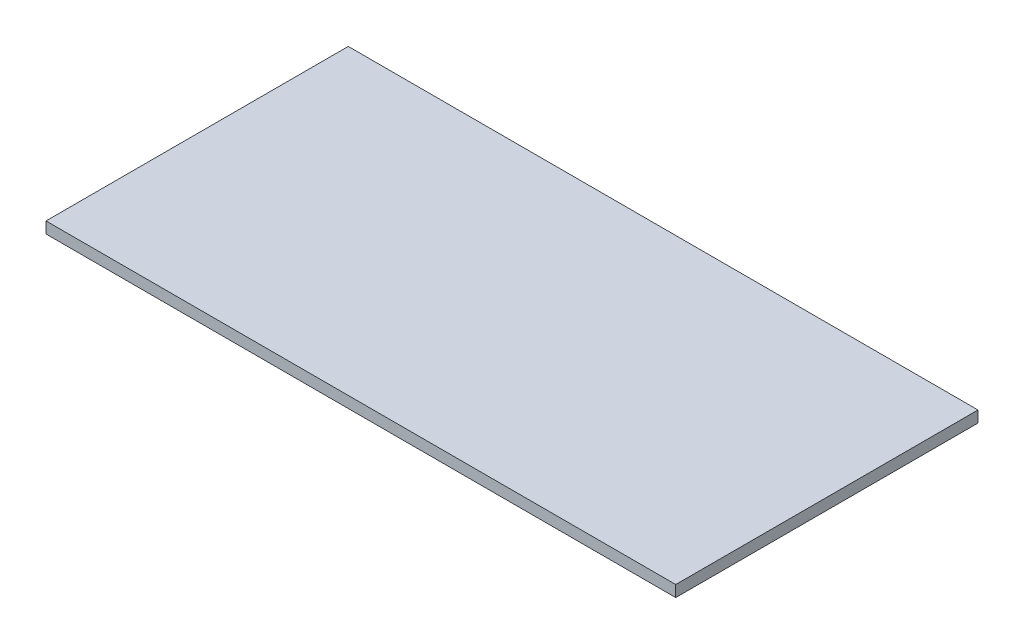
ISO-10303-21;
HEADER;
FILE_DESCRIPTION(('STEP AP214'),'2;1');
FILE_NAME('part.step','',(''),(''),'','','');
FILE_SCHEMA(('AUTOMOTIVE_DESIGN { 1 0 10303 214 1 1 1 1 }'));
ENDSEC;
DATA;
#1=APPLICATION_CONTEXT('core data for automotive mechanical design processes');
#2=APPLICATION_PROTOCOL_DEFINITION('international standard','automotive_design',2000,#1);
#3=PRODUCT_CONTEXT('',#1,'mechanical');
#4=PRODUCT('Part','Part','',(#3));
#5=PRODUCT_RELATED_PRODUCT_CATEGORY('part','',(#4));
#6=PRODUCT_DEFINITION_FORMATION('','',#4);
#7=PRODUCT_DEFINITION_CONTEXT('part definition',#1,'design');
#8=PRODUCT_DEFINITION('design','',#6,#7);
#9=PRODUCT_DEFINITION_SHAPE('','',#8);
#10=(LENGTH_UNIT() NAMED_UNIT(*) SI_UNIT(.MILLI.,.METRE.));
#11=(NAMED_UNIT(*) PLANE_ANGLE_UNIT() SI_UNIT($,.RADIAN.));
#12=(NAMED_UNIT(*) SI_UNIT($,.STERADIAN.) SOLID_ANGLE_UNIT());
#13=UNCERTAINTY_MEASURE_WITH_UNIT(LENGTH_MEASURE(1.E-05),#10,'distance_accuracy_value','');
#14=(GEOMETRIC_REPRESENTATION_CONTEXT(3) GLOBAL_UNCERTAINTY_ASSIGNED_CONTEXT((#13)) GLOBAL_UNIT_ASSIGNED_CONTEXT((#10,
#11,#12)) REPRESENTATION_CONTEXT('',''));
#15=CARTESIAN_POINT('',(0.,0.,0.));
#16=DIRECTION('',(0.,0.,1.));
#17=DIRECTION('',(1.,0.,0.));
#18=AXIS2_PLACEMENT_3D('',#15,#16,#17);
#19=CARTESIAN_POINT('',(0.,1.8,0.));
#20=DIRECTION('',(1.,0.,0.));
#21=DIRECTION('',(0.,0.,-1.));
#22=AXIS2_PLACEMENT_3D('',#19,#20,#21);
#23=PLANE('',#22);
#24=DIRECTION('',(0.,0.,1.));
#25=VECTOR('',#24,1.);
#26=CARTESIAN_POINT('',(0.,0.,0.));
#27=LINE('',#26,#25);
#28=CARTESIAN_POINT('',(0.,0.,-48.));
#29=VERTEX_POINT('',#28);
#30=CARTESIAN_POINT('',(0.,0.,0.));
#31=VERTEX_POINT('',#30);
#32=EDGE_CURVE('E98',#29,#31,#27,.T.);
#33=ORIENTED_EDGE('',*,*,#32,.T.);
#34=DIRECTION('',(0.,-1.,0.));
#35=VECTOR('',#34,1.);
#36=CARTESIAN_POINT('',(0.,1.8,0.));
#37=LINE('',#36,#35);
#38=CARTESIAN_POINT('',(0.,1.8,0.));
#39=VERTEX_POINT('',#38);
#40=EDGE_CURVE('E11',#39,#31,#37,.T.);
#41=ORIENTED_EDGE('',*,*,#40,.F.);
#42=DIRECTION('',(0.,0.,1.));
#43=VECTOR('',#42,1.);
#44=CARTESIAN_POINT('',(0.,1.8,0.));
#45=LINE('',#44,#43);
#46=CARTESIAN_POINT('',(0.,1.8,-48.));
#47=VERTEX_POINT('',#46);
#48=EDGE_CURVE('E86',#47,#39,#45,.T.);
#49=ORIENTED_EDGE('',*,*,#48,.F.);
#50=DIRECTION('',(0.,-1.,0.));
#51=VECTOR('',#50,1.);
#52=CARTESIAN_POINT('',(0.,1.8,-48.));
#53=LINE('',#52,#51);
#54=EDGE_CURVE('E94',#47,#29,#53,.T.);
#55=ORIENTED_EDGE('',*,*,#54,.T.);
#56=EDGE_LOOP('',(#33,#41,#49,#55));
#57=FACE_BOUND('',#56,.T.);
#58=ADVANCED_FACE('F35',(#57),#23,.F.);
#59=CARTESIAN_POINT('',(0.,1.8,0.));
#60=DIRECTION('',(0.,0.,-1.));
#61=DIRECTION('',(-1.,0.,0.));
#62=AXIS2_PLACEMENT_3D('',#59,#60,#61);
#63=PLANE('',#62);
#64=DIRECTION('',(1.,0.,0.));
#65=VECTOR('',#64,1.);
#66=CARTESIAN_POINT('',(0.,0.,0.));
#67=LINE('',#66,#65);
#68=CARTESIAN_POINT('',(100.,0.,0.));
#69=VERTEX_POINT('',#68);
#70=EDGE_CURVE('E90',#31,#69,#67,.T.);
#71=ORIENTED_EDGE('',*,*,#70,.T.);
#72=DIRECTION('',(0.,-1.,0.));
#73=VECTOR('',#72,1.);
#74=CARTESIAN_POINT('',(100.,1.8,0.));
#75=LINE('',#74,#73);
#76=CARTESIAN_POINT('',(100.,1.8,0.));
#77=VERTEX_POINT('',#76);
#78=EDGE_CURVE('E43',#77,#69,#75,.T.);
#79=ORIENTED_EDGE('',*,*,#78,.F.);
#80=DIRECTION('',(1.,0.,0.));
#81=VECTOR('',#80,1.);
#82=CARTESIAN_POINT('',(0.,1.8,0.));
#83=LINE('',#82,#81);
#84=EDGE_CURVE('E81',#39,#77,#83,.T.);
#85=ORIENTED_EDGE('',*,*,#84,.F.);
#86=ORIENTED_EDGE('',*,*,#40,.T.);
#87=EDGE_LOOP('',(#71,#79,#85,#86));
#88=FACE_BOUND('',#87,.T.);
#89=ADVANCED_FACE('F89',(#88),#63,.F.);
#90=CARTESIAN_POINT('',(100.,1.8,0.));
#91=DIRECTION('',(-1.,0.,0.));
#92=DIRECTION('',(0.,0.,1.));
#93=AXIS2_PLACEMENT_3D('',#90,#91,#92);
#94=PLANE('',#93);
#95=DIRECTION('',(0.,0.,-1.));
#96=VECTOR('',#95,1.);
#97=CARTESIAN_POINT('',(100.,0.,0.));
#98=LINE('',#97,#96);
#99=CARTESIAN_POINT('',(100.,0.,-48.));
#100=VERTEX_POINT('',#99);
#101=EDGE_CURVE('E68',#69,#100,#98,.T.);
#102=ORIENTED_EDGE('',*,*,#101,.T.);
#103=DIRECTION('',(0.,-1.,0.));
#104=VECTOR('',#103,1.);
#105=CARTESIAN_POINT('',(100.,1.8,-48.));
#106=LINE('',#105,#104);
#107=CARTESIAN_POINT('',(100.,1.8,-48.));
#108=VERTEX_POINT('',#107);
#109=EDGE_CURVE('E91',#108,#100,#106,.T.);
#110=ORIENTED_EDGE('',*,*,#109,.F.);
#111=DIRECTION('',(0.,0.,-1.));
#112=VECTOR('',#111,1.);
#113=CARTESIAN_POINT('',(100.,1.8,0.));
#114=LINE('',#113,#112);
#115=EDGE_CURVE('E84',#77,#108,#114,.T.);
#116=ORIENTED_EDGE('',*,*,#115,.F.);
#117=ORIENTED_EDGE('',*,*,#78,.T.);
#118=EDGE_LOOP('',(#102,#110,#116,#117));
#119=FACE_BOUND('',#118,.T.);
#120=ADVANCED_FACE('F92',(#119),#94,.F.);
#121=CARTESIAN_POINT('',(0.,1.8,-48.));
#122=DIRECTION('',(0.,0.,1.));
#123=DIRECTION('',(1.,0.,0.));
#124=AXIS2_PLACEMENT_3D('',#121,#122,#123);
#125=PLANE('',#124);
#126=DIRECTION('',(-1.,0.,0.));
#127=VECTOR('',#126,1.);
#128=CARTESIAN_POINT('',(0.,0.,-48.));
#129=LINE('',#128,#127);
#130=EDGE_CURVE('E74',#100,#29,#129,.T.);
#131=ORIENTED_EDGE('',*,*,#130,.T.);
#132=ORIENTED_EDGE('',*,*,#54,.F.);
#133=DIRECTION('',(-1.,0.,0.));
#134=VECTOR('',#133,1.);
#135=CARTESIAN_POINT('',(0.,1.8,-48.));
#136=LINE('',#135,#134);
#137=EDGE_CURVE('E51',#108,#47,#136,.T.);
#138=ORIENTED_EDGE('',*,*,#137,.F.);
#139=ORIENTED_EDGE('',*,*,#109,.T.);
#140=EDGE_LOOP('',(#131,#132,#138,#139));
#141=FACE_BOUND('',#140,.T.);
#142=ADVANCED_FACE('F105',(#141),#125,.F.);
#143=CARTESIAN_POINT('',(0.,1.8,0.));
#144=DIRECTION('',(0.,-1.,0.));
#145=DIRECTION('',(0.,0.,-1.));
#146=AXIS2_PLACEMENT_3D('',#143,#144,#145);
#147=PLANE('',#146);
#148=ORIENTED_EDGE('',*,*,#48,.T.);
#149=ORIENTED_EDGE('',*,*,#84,.T.);
#150=ORIENTED_EDGE('',*,*,#115,.T.);
#151=ORIENTED_EDGE('',*,*,#137,.T.);
#152=EDGE_LOOP('',(#148,#149,#150,#151));
#153=FACE_BOUND('',#152,.T.);
#154=ADVANCED_FACE('F82',(#153),#147,.F.);
#155=CARTESIAN_POINT('',(0.,0.,0.));
#156=DIRECTION('',(0.,-1.,0.));
#157=DIRECTION('',(0.,0.,-1.));
#158=AXIS2_PLACEMENT_3D('',#155,#156,#157);
#159=PLANE('',#158);
#160=ORIENTED_EDGE('',*,*,#32,.F.);
#161=ORIENTED_EDGE('',*,*,#130,.F.);
#162=ORIENTED_EDGE('',*,*,#101,.F.);
#163=ORIENTED_EDGE('',*,*,#70,.F.);
#164=EDGE_LOOP('',(#160,#161,#162,#163));
#165=FACE_BOUND('',#164,.T.);
#166=ADVANCED_FACE('F108',(#165),#159,.T.);
#167=CLOSED_SHELL('',(#58,#89,#120,#142,#154,#166));
#168=MANIFOLD_SOLID_BREP('B2',#167);
#169=ADVANCED_BREP_SHAPE_REPRESENTATION('',(#18,#168),#14);
#170=SHAPE_DEFINITION_REPRESENTATION(#9,#169);
ENDSEC;
END-ISO-10303-21;
